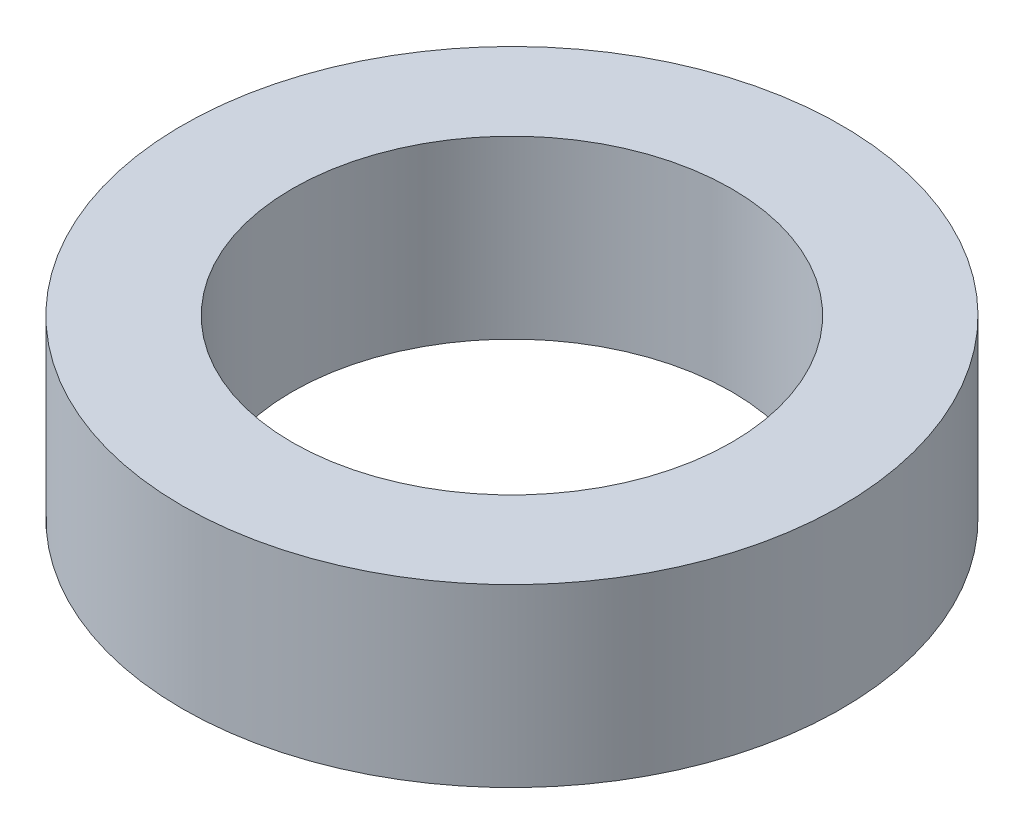
ISO-10303-21;
HEADER;
FILE_DESCRIPTION(('STEP AP214'),'2;1');
FILE_NAME('part.step','',(''),(''),'','','');
FILE_SCHEMA(('AUTOMOTIVE_DESIGN { 1 0 10303 214 1 1 1 1 }'));
ENDSEC;
DATA;
#1=APPLICATION_CONTEXT('core data for automotive mechanical design processes');
#2=APPLICATION_PROTOCOL_DEFINITION('international standard','automotive_design',2000,#1);
#3=PRODUCT_CONTEXT('',#1,'mechanical');
#4=PRODUCT('Part','Part','',(#3));
#5=PRODUCT_RELATED_PRODUCT_CATEGORY('part','',(#4));
#6=PRODUCT_DEFINITION_FORMATION('','',#4);
#7=PRODUCT_DEFINITION_CONTEXT('part definition',#1,'design');
#8=PRODUCT_DEFINITION('design','',#6,#7);
#9=PRODUCT_DEFINITION_SHAPE('','',#8);
#10=(LENGTH_UNIT() NAMED_UNIT(*) SI_UNIT(.MILLI.,.METRE.));
#11=(NAMED_UNIT(*) PLANE_ANGLE_UNIT() SI_UNIT($,.RADIAN.));
#12=(NAMED_UNIT(*) SI_UNIT($,.STERADIAN.) SOLID_ANGLE_UNIT());
#13=UNCERTAINTY_MEASURE_WITH_UNIT(LENGTH_MEASURE(1.E-05),#10,'distance_accuracy_value','');
#14=(GEOMETRIC_REPRESENTATION_CONTEXT(3) GLOBAL_UNCERTAINTY_ASSIGNED_CONTEXT((#13)) GLOBAL_UNIT_ASSIGNED_CONTEXT((#10,
#11,#12)) REPRESENTATION_CONTEXT('',''));
#15=CARTESIAN_POINT('',(0.,0.,0.));
#16=DIRECTION('',(0.,0.,1.));
#17=DIRECTION('',(1.,0.,0.));
#18=AXIS2_PLACEMENT_3D('',#15,#16,#17);
#19=CARTESIAN_POINT('',(0.,2.,0.));
#20=DIRECTION('',(0.,1.,0.));
#21=DIRECTION('',(0.,0.,1.));
#22=AXIS2_PLACEMENT_3D('',#19,#20,#21);
#23=PLANE('',#22);
#24=CARTESIAN_POINT('',(0.,2.,0.));
#25=DIRECTION('',(0.,1.,0.));
#26=DIRECTION('',(0.,0.,1.));
#27=AXIS2_PLACEMENT_3D('',#24,#25,#26);
#28=CIRCLE('',#27,7.5);
#29=CARTESIAN_POINT('',(0.,2.,7.5));
#30=VERTEX_POINT('',#29);
#31=EDGE_CURVE('E10',#30,#30,#28,.T.);
#32=ORIENTED_EDGE('',*,*,#31,.T.);
#33=EDGE_LOOP('',(#32));
#34=FACE_BOUND('',#33,.T.);
#35=CARTESIAN_POINT('',(0.,2.,0.));
#36=DIRECTION('',(0.,1.,0.));
#37=DIRECTION('',(0.,0.,1.));
#38=AXIS2_PLACEMENT_3D('',#35,#36,#37);
#39=CIRCLE('',#38,5.);
#40=CARTESIAN_POINT('',(0.,2.,5.));
#41=VERTEX_POINT('',#40);
#42=EDGE_CURVE('E54',#41,#41,#39,.T.);
#43=ORIENTED_EDGE('',*,*,#42,.F.);
#44=EDGE_LOOP('',(#43));
#45=FACE_BOUND('',#44,.T.);
#46=ADVANCED_FACE('F41',(#34,#45),#23,.T.);
#47=CARTESIAN_POINT('',(0.,-2.,0.));
#48=DIRECTION('',(0.,1.,0.));
#49=DIRECTION('',(0.,0.,1.));
#50=AXIS2_PLACEMENT_3D('',#47,#48,#49);
#51=PLANE('',#50);
#52=CARTESIAN_POINT('',(0.,-2.,0.));
#53=DIRECTION('',(0.,1.,0.));
#54=DIRECTION('',(0.,0.,1.));
#55=AXIS2_PLACEMENT_3D('',#52,#53,#54);
#56=CIRCLE('',#55,7.5);
#57=CARTESIAN_POINT('',(0.,-2.,7.5));
#58=VERTEX_POINT('',#57);
#59=EDGE_CURVE('E45',#58,#58,#56,.T.);
#60=ORIENTED_EDGE('',*,*,#59,.F.);
#61=EDGE_LOOP('',(#60));
#62=FACE_BOUND('',#61,.T.);
#63=CARTESIAN_POINT('',(0.,-2.,0.));
#64=DIRECTION('',(0.,1.,0.));
#65=DIRECTION('',(0.,0.,1.));
#66=AXIS2_PLACEMENT_3D('',#63,#64,#65);
#67=CIRCLE('',#66,5.);
#68=CARTESIAN_POINT('',(0.,-2.,5.));
#69=VERTEX_POINT('',#68);
#70=EDGE_CURVE('E56',#69,#69,#67,.T.);
#71=ORIENTED_EDGE('',*,*,#70,.T.);
#72=EDGE_LOOP('',(#71));
#73=FACE_BOUND('',#72,.T.);
#74=ADVANCED_FACE('F68',(#62,#73),#51,.F.);
#75=CARTESIAN_POINT('',(0.,2.,0.));
#76=DIRECTION('',(0.,-1.,0.));
#77=DIRECTION('',(0.,0.,-1.));
#78=AXIS2_PLACEMENT_3D('',#75,#76,#77);
#79=CYLINDRICAL_SURFACE('',#78,7.5);
#80=ORIENTED_EDGE('',*,*,#31,.F.);
#81=EDGE_LOOP('',(#80));
#82=FACE_BOUND('',#81,.T.);
#83=ORIENTED_EDGE('',*,*,#59,.T.);
#84=EDGE_LOOP('',(#83));
#85=FACE_BOUND('',#84,.T.);
#86=ADVANCED_FACE('F43',(#82,#85),#79,.T.);
#87=CARTESIAN_POINT('',(0.,2.,0.));
#88=DIRECTION('',(0.,-1.,0.));
#89=DIRECTION('',(0.,0.,-1.));
#90=AXIS2_PLACEMENT_3D('',#87,#88,#89);
#91=CYLINDRICAL_SURFACE('',#90,5.);
#92=ORIENTED_EDGE('',*,*,#42,.T.);
#93=EDGE_LOOP('',(#92));
#94=FACE_BOUND('',#93,.T.);
#95=ORIENTED_EDGE('',*,*,#70,.F.);
#96=EDGE_LOOP('',(#95));
#97=FACE_BOUND('',#96,.T.);
#98=ADVANCED_FACE('F64',(#94,#97),#91,.F.);
#99=CLOSED_SHELL('',(#46,#74,#86,#98));
#100=MANIFOLD_SOLID_BREP('B2',#99);
#101=ADVANCED_BREP_SHAPE_REPRESENTATION('',(#18,#100),#14);
#102=SHAPE_DEFINITION_REPRESENTATION(#9,#101);
ENDSEC;
END-ISO-10303-21;
